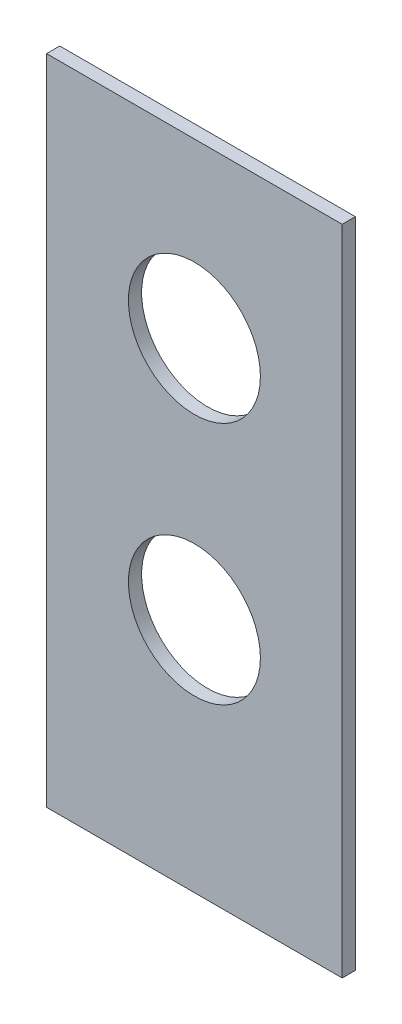
ISO-10303-21;
HEADER;
FILE_DESCRIPTION(('STEP AP214'),'2;1');
FILE_NAME('part.step','',(''),(''),'','','');
FILE_SCHEMA(('AUTOMOTIVE_DESIGN { 1 0 10303 214 1 1 1 1 }'));
ENDSEC;
DATA;
#1=APPLICATION_CONTEXT('core data for automotive mechanical design processes');
#2=APPLICATION_PROTOCOL_DEFINITION('international standard','automotive_design',2000,#1);
#3=PRODUCT_CONTEXT('',#1,'mechanical');
#4=PRODUCT('Part','Part','',(#3));
#5=PRODUCT_RELATED_PRODUCT_CATEGORY('part','',(#4));
#6=PRODUCT_DEFINITION_FORMATION('','',#4);
#7=PRODUCT_DEFINITION_CONTEXT('part definition',#1,'design');
#8=PRODUCT_DEFINITION('design','',#6,#7);
#9=PRODUCT_DEFINITION_SHAPE('','',#8);
#10=(LENGTH_UNIT() NAMED_UNIT(*) SI_UNIT(.MILLI.,.METRE.));
#11=(NAMED_UNIT(*) PLANE_ANGLE_UNIT() SI_UNIT($,.RADIAN.));
#12=(NAMED_UNIT(*) SI_UNIT($,.STERADIAN.) SOLID_ANGLE_UNIT());
#13=UNCERTAINTY_MEASURE_WITH_UNIT(LENGTH_MEASURE(1.E-05),#10,'distance_accuracy_value','');
#14=(GEOMETRIC_REPRESENTATION_CONTEXT(3) GLOBAL_UNCERTAINTY_ASSIGNED_CONTEXT((#13)) GLOBAL_UNIT_ASSIGNED_CONTEXT((#10,
#11,#12)) REPRESENTATION_CONTEXT('',''));
#15=CARTESIAN_POINT('',(0.,0.,0.));
#16=DIRECTION('',(0.,0.,1.));
#17=DIRECTION('',(1.,0.,0.));
#18=AXIS2_PLACEMENT_3D('',#15,#16,#17);
#19=CARTESIAN_POINT('',(28.4455825623334,62.8028571428571,2.54));
#20=DIRECTION('',(-1.,0.,0.));
#21=DIRECTION('',(0.,0.,1.));
#22=AXIS2_PLACEMENT_3D('',#19,#20,#21);
#23=PLANE('',#22);
#24=DIRECTION('',(0.,1.,0.));
#25=VECTOR('',#24,1.);
#26=CARTESIAN_POINT('',(28.4455825623334,62.8028571428571,0.));
#27=LINE('',#26,#25);
#28=CARTESIAN_POINT('',(28.4455825623334,-62.8028571428571,0.));
#29=VERTEX_POINT('',#28);
#30=CARTESIAN_POINT('',(28.4455825623334,62.8028571428571,0.));
#31=VERTEX_POINT('',#30);
#32=EDGE_CURVE('E96',#29,#31,#27,.T.);
#33=ORIENTED_EDGE('',*,*,#32,.T.);
#34=DIRECTION('',(0.,0.,-1.));
#35=VECTOR('',#34,1.);
#36=CARTESIAN_POINT('',(28.4455825623334,62.8028571428571,2.54));
#37=LINE('',#36,#35);
#38=CARTESIAN_POINT('',(28.4455825623334,62.8028571428571,2.54));
#39=VERTEX_POINT('',#38);
#40=EDGE_CURVE('E11',#39,#31,#37,.T.);
#41=ORIENTED_EDGE('',*,*,#40,.F.);
#42=DIRECTION('',(0.,1.,0.));
#43=VECTOR('',#42,1.);
#44=CARTESIAN_POINT('',(28.4455825623334,62.8028571428571,2.54));
#45=LINE('',#44,#43);
#46=CARTESIAN_POINT('',(28.4455825623334,-62.8028571428571,2.54));
#47=VERTEX_POINT('',#46);
#48=EDGE_CURVE('E84',#47,#39,#45,.T.);
#49=ORIENTED_EDGE('',*,*,#48,.F.);
#50=DIRECTION('',(0.,0.,-1.));
#51=VECTOR('',#50,1.);
#52=CARTESIAN_POINT('',(28.4455825623334,-62.8028571428571,2.54));
#53=LINE('',#52,#51);
#54=EDGE_CURVE('E92',#47,#29,#53,.T.);
#55=ORIENTED_EDGE('',*,*,#54,.T.);
#56=EDGE_LOOP('',(#33,#41,#49,#55));
#57=FACE_BOUND('',#56,.T.);
#58=ADVANCED_FACE('F33',(#57),#23,.F.);
#59=CARTESIAN_POINT('',(-28.4455825623334,62.8028571428571,2.54));
#60=DIRECTION('',(0.,-1.,0.));
#61=DIRECTION('',(0.,0.,-1.));
#62=AXIS2_PLACEMENT_3D('',#59,#60,#61);
#63=PLANE('',#62);
#64=DIRECTION('',(-1.,0.,0.));
#65=VECTOR('',#64,1.);
#66=CARTESIAN_POINT('',(-28.4455825623334,62.8028571428571,0.));
#67=LINE('',#66,#65);
#68=CARTESIAN_POINT('',(-28.4455825623334,62.8028571428571,0.));
#69=VERTEX_POINT('',#68);
#70=EDGE_CURVE('E88',#31,#69,#67,.T.);
#71=ORIENTED_EDGE('',*,*,#70,.T.);
#72=DIRECTION('',(0.,0.,-1.));
#73=VECTOR('',#72,1.);
#74=CARTESIAN_POINT('',(-28.4455825623334,62.8028571428571,2.54));
#75=LINE('',#74,#73);
#76=CARTESIAN_POINT('',(-28.4455825623334,62.8028571428571,2.54));
#77=VERTEX_POINT('',#76);
#78=EDGE_CURVE('E41',#77,#69,#75,.T.);
#79=ORIENTED_EDGE('',*,*,#78,.F.);
#80=DIRECTION('',(-1.,0.,0.));
#81=VECTOR('',#80,1.);
#82=CARTESIAN_POINT('',(-28.4455825623334,62.8028571428571,2.54));
#83=LINE('',#82,#81);
#84=EDGE_CURVE('E79',#39,#77,#83,.T.);
#85=ORIENTED_EDGE('',*,*,#84,.F.);
#86=ORIENTED_EDGE('',*,*,#40,.T.);
#87=EDGE_LOOP('',(#71,#79,#85,#86));
#88=FACE_BOUND('',#87,.T.);
#89=ADVANCED_FACE('F87',(#88),#63,.F.);
#90=CARTESIAN_POINT('',(-28.4455825623334,62.8028571428571,2.54));
#91=DIRECTION('',(1.,0.,0.));
#92=DIRECTION('',(0.,0.,-1.));
#93=AXIS2_PLACEMENT_3D('',#90,#91,#92);
#94=PLANE('',#93);
#95=DIRECTION('',(0.,-1.,0.));
#96=VECTOR('',#95,1.);
#97=CARTESIAN_POINT('',(-28.4455825623334,62.8028571428571,0.));
#98=LINE('',#97,#96);
#99=CARTESIAN_POINT('',(-28.4455825623334,-62.8028571428571,0.));
#100=VERTEX_POINT('',#99);
#101=EDGE_CURVE('E66',#69,#100,#98,.T.);
#102=ORIENTED_EDGE('',*,*,#101,.T.);
#103=DIRECTION('',(0.,0.,-1.));
#104=VECTOR('',#103,1.);
#105=CARTESIAN_POINT('',(-28.4455825623334,-62.8028571428571,2.54));
#106=LINE('',#105,#104);
#107=CARTESIAN_POINT('',(-28.4455825623334,-62.8028571428571,2.54));
#108=VERTEX_POINT('',#107);
#109=EDGE_CURVE('E89',#108,#100,#106,.T.);
#110=ORIENTED_EDGE('',*,*,#109,.F.);
#111=DIRECTION('',(0.,-1.,0.));
#112=VECTOR('',#111,1.);
#113=CARTESIAN_POINT('',(-28.4455825623334,62.8028571428571,2.54));
#114=LINE('',#113,#112);
#115=EDGE_CURVE('E82',#77,#108,#114,.T.);
#116=ORIENTED_EDGE('',*,*,#115,.F.);
#117=ORIENTED_EDGE('',*,*,#78,.T.);
#118=EDGE_LOOP('',(#102,#110,#116,#117));
#119=FACE_BOUND('',#118,.T.);
#120=ADVANCED_FACE('F90',(#119),#94,.F.);
#121=CARTESIAN_POINT('',(-28.4455825623334,-62.8028571428571,2.54));
#122=DIRECTION('',(0.,1.,0.));
#123=DIRECTION('',(0.,0.,1.));
#124=AXIS2_PLACEMENT_3D('',#121,#122,#123);
#125=PLANE('',#124);
#126=DIRECTION('',(1.,0.,0.));
#127=VECTOR('',#126,1.);
#128=CARTESIAN_POINT('',(-28.4455825623334,-62.8028571428571,0.));
#129=LINE('',#128,#127);
#130=EDGE_CURVE('E72',#100,#29,#129,.T.);
#131=ORIENTED_EDGE('',*,*,#130,.T.);
#132=ORIENTED_EDGE('',*,*,#54,.F.);
#133=DIRECTION('',(1.,0.,0.));
#134=VECTOR('',#133,1.);
#135=CARTESIAN_POINT('',(-28.4455825623334,-62.8028571428571,2.54));
#136=LINE('',#135,#134);
#137=EDGE_CURVE('E49',#108,#47,#136,.T.);
#138=ORIENTED_EDGE('',*,*,#137,.F.);
#139=ORIENTED_EDGE('',*,*,#109,.T.);
#140=EDGE_LOOP('',(#131,#132,#138,#139));
#141=FACE_BOUND('',#140,.T.);
#142=ADVANCED_FACE('F104',(#141),#125,.F.);
#143=CARTESIAN_POINT('',(0.,0.,2.54));
#144=DIRECTION('',(0.,0.,1.));
#145=DIRECTION('',(1.,0.,0.));
#146=AXIS2_PLACEMENT_3D('',#143,#144,#145);
#147=PLANE('',#146);
#148=CARTESIAN_POINT('',(0.,29.58,2.54));
#149=DIRECTION('',(0.,0.,1.));
#150=DIRECTION('',(1.,0.,0.));
#151=AXIS2_PLACEMENT_3D('',#148,#149,#150);
#152=CIRCLE('',#151,12.7);
#153=CARTESIAN_POINT('',(12.7,29.58,2.54));
#154=VERTEX_POINT('',#153);
#155=EDGE_CURVE('E113',#154,#154,#152,.T.);
#156=ORIENTED_EDGE('',*,*,#155,.F.);
#157=EDGE_LOOP('',(#156));
#158=FACE_BOUND('',#157,.T.);
#159=CARTESIAN_POINT('',(0.,-17.34,2.54));
#160=DIRECTION('',(0.,0.,1.));
#161=DIRECTION('',(1.,0.,0.));
#162=AXIS2_PLACEMENT_3D('',#159,#160,#161);
#163=CIRCLE('',#162,12.7);
#164=CARTESIAN_POINT('',(12.7,-17.34,2.54));
#165=VERTEX_POINT('',#164);
#166=EDGE_CURVE('E114',#165,#165,#163,.T.);
#167=ORIENTED_EDGE('',*,*,#166,.F.);
#168=EDGE_LOOP('',(#167));
#169=FACE_BOUND('',#168,.T.);
#170=ORIENTED_EDGE('',*,*,#48,.T.);
#171=ORIENTED_EDGE('',*,*,#84,.T.);
#172=ORIENTED_EDGE('',*,*,#115,.T.);
#173=ORIENTED_EDGE('',*,*,#137,.T.);
#174=EDGE_LOOP('',(#170,#171,#172,#173));
#175=FACE_BOUND('',#174,.T.);
#176=ADVANCED_FACE('F80',(#158,#169,#175),#147,.T.);
#177=CARTESIAN_POINT('',(0.,0.,0.));
#178=DIRECTION('',(0.,0.,1.));
#179=DIRECTION('',(1.,0.,0.));
#180=AXIS2_PLACEMENT_3D('',#177,#178,#179);
#181=PLANE('',#180);
#182=CARTESIAN_POINT('',(0.,29.58,0.));
#183=DIRECTION('',(0.,0.,1.));
#184=DIRECTION('',(1.,0.,0.));
#185=AXIS2_PLACEMENT_3D('',#182,#183,#184);
#186=CIRCLE('',#185,12.7);
#187=CARTESIAN_POINT('',(12.7,29.58,0.));
#188=VERTEX_POINT('',#187);
#189=EDGE_CURVE('E99',#188,#188,#186,.F.);
#190=ORIENTED_EDGE('',*,*,#189,.F.);
#191=EDGE_LOOP('',(#190));
#192=FACE_BOUND('',#191,.T.);
#193=CARTESIAN_POINT('',(0.,-17.34,0.));
#194=DIRECTION('',(0.,0.,1.));
#195=DIRECTION('',(1.,0.,0.));
#196=AXIS2_PLACEMENT_3D('',#193,#194,#195);
#197=CIRCLE('',#196,12.7);
#198=CARTESIAN_POINT('',(12.7,-17.34,0.));
#199=VERTEX_POINT('',#198);
#200=EDGE_CURVE('E110',#199,#199,#197,.F.);
#201=ORIENTED_EDGE('',*,*,#200,.F.);
#202=EDGE_LOOP('',(#201));
#203=FACE_BOUND('',#202,.T.);
#204=ORIENTED_EDGE('',*,*,#32,.F.);
#205=ORIENTED_EDGE('',*,*,#130,.F.);
#206=ORIENTED_EDGE('',*,*,#101,.F.);
#207=ORIENTED_EDGE('',*,*,#70,.F.);
#208=EDGE_LOOP('',(#204,#205,#206,#207));
#209=FACE_BOUND('',#208,.T.);
#210=ADVANCED_FACE('F107',(#192,#203,#209),#181,.F.);
#211=CARTESIAN_POINT('',(0.,-17.34,-0.00100000000000013));
#212=DIRECTION('',(0.,0.,1.));
#213=DIRECTION('',(1.,0.,0.));
#214=AXIS2_PLACEMENT_3D('',#211,#212,#213);
#215=CYLINDRICAL_SURFACE('',#214,12.7);
#216=ORIENTED_EDGE('',*,*,#166,.T.);
#217=EDGE_LOOP('',(#216));
#218=FACE_BOUND('',#217,.T.);
#219=ORIENTED_EDGE('',*,*,#200,.T.);
#220=EDGE_LOOP('',(#219));
#221=FACE_BOUND('',#220,.T.);
#222=ADVANCED_FACE('F130',(#218,#221),#215,.F.);
#223=CARTESIAN_POINT('',(0.,29.58,-0.00100000000000013));
#224=DIRECTION('',(0.,0.,1.));
#225=DIRECTION('',(1.,0.,0.));
#226=AXIS2_PLACEMENT_3D('',#223,#224,#225);
#227=CYLINDRICAL_SURFACE('',#226,12.7);
#228=ORIENTED_EDGE('',*,*,#155,.T.);
#229=EDGE_LOOP('',(#228));
#230=FACE_BOUND('',#229,.T.);
#231=ORIENTED_EDGE('',*,*,#189,.T.);
#232=EDGE_LOOP('',(#231));
#233=FACE_BOUND('',#232,.T.);
#234=ADVANCED_FACE('F122',(#230,#233),#227,.F.);
#235=CLOSED_SHELL('',(#58,#89,#120,#142,#176,#210,#222,#234));
#236=MANIFOLD_SOLID_BREP('B2',#235);
#237=ADVANCED_BREP_SHAPE_REPRESENTATION('',(#18,#236),#14);
#238=SHAPE_DEFINITION_REPRESENTATION(#9,#237);
ENDSEC;
END-ISO-10303-21;
